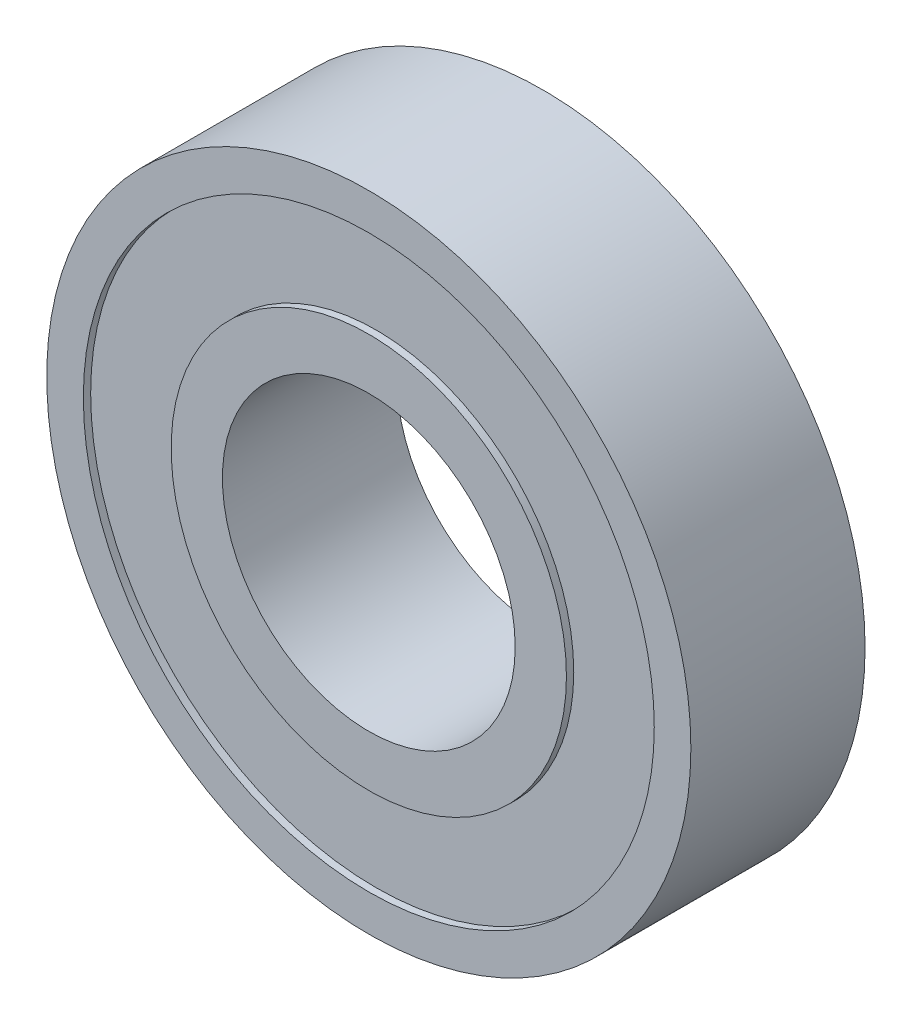
ISO-10303-21;
HEADER;
FILE_DESCRIPTION(('STEP AP214'),'2;1');
FILE_NAME('part.step','',(''),(''),'','','');
FILE_SCHEMA(('AUTOMOTIVE_DESIGN { 1 0 10303 214 1 1 1 1 }'));
ENDSEC;
DATA;
#1=APPLICATION_CONTEXT('core data for automotive mechanical design processes');
#2=APPLICATION_PROTOCOL_DEFINITION('international standard','automotive_design',2000,#1);
#3=PRODUCT_CONTEXT('',#1,'mechanical');
#4=PRODUCT('Part','Part','',(#3));
#5=PRODUCT_RELATED_PRODUCT_CATEGORY('part','',(#4));
#6=PRODUCT_DEFINITION_FORMATION('','',#4);
#7=PRODUCT_DEFINITION_CONTEXT('part definition',#1,'design');
#8=PRODUCT_DEFINITION('design','',#6,#7);
#9=PRODUCT_DEFINITION_SHAPE('','',#8);
#10=(LENGTH_UNIT() NAMED_UNIT(*) SI_UNIT(.MILLI.,.METRE.));
#11=(NAMED_UNIT(*) PLANE_ANGLE_UNIT() SI_UNIT($,.RADIAN.));
#12=(NAMED_UNIT(*) SI_UNIT($,.STERADIAN.) SOLID_ANGLE_UNIT());
#13=UNCERTAINTY_MEASURE_WITH_UNIT(LENGTH_MEASURE(1.E-05),#10,'distance_accuracy_value','');
#14=(GEOMETRIC_REPRESENTATION_CONTEXT(3) GLOBAL_UNCERTAINTY_ASSIGNED_CONTEXT((#13)) GLOBAL_UNIT_ASSIGNED_CONTEXT((#10,
#11,#12)) REPRESENTATION_CONTEXT('',''));
#15=CARTESIAN_POINT('',(0.,0.,0.));
#16=DIRECTION('',(0.,0.,1.));
#17=DIRECTION('',(1.,0.,0.));
#18=AXIS2_PLACEMENT_3D('',#15,#16,#17);
#19=CARTESIAN_POINT('',(0.,0.,0.));
#20=DIRECTION('',(0.,0.,1.));
#21=DIRECTION('',(1.,0.,0.));
#22=AXIS2_PLACEMENT_3D('',#19,#20,#21);
#23=PLANE('',#22);
#24=CARTESIAN_POINT('',(0.,0.,0.));
#25=DIRECTION('',(0.,0.,1.));
#26=DIRECTION('',(1.,0.,0.));
#27=AXIS2_PLACEMENT_3D('',#24,#25,#26);
#28=CIRCLE('',#27,5.);
#29=CARTESIAN_POINT('',(5.,0.,0.));
#30=VERTEX_POINT('',#29);
#31=EDGE_CURVE('E43',#30,#30,#28,.T.);
#32=ORIENTED_EDGE('',*,*,#31,.T.);
#33=EDGE_LOOP('',(#32));
#34=FACE_BOUND('',#33,.T.);
#35=CARTESIAN_POINT('',(0.,0.,0.));
#36=DIRECTION('',(0.,0.,1.));
#37=DIRECTION('',(1.,0.,0.));
#38=AXIS2_PLACEMENT_3D('',#35,#36,#37);
#39=CIRCLE('',#38,6.75);
#40=CARTESIAN_POINT('',(6.75,0.,0.));
#41=VERTEX_POINT('',#40);
#42=EDGE_CURVE('E67',#41,#41,#39,.T.);
#43=ORIENTED_EDGE('',*,*,#42,.F.);
#44=EDGE_LOOP('',(#43));
#45=FACE_BOUND('',#44,.T.);
#46=ADVANCED_FACE('F30',(#34,#45),#23,.F.);
#47=CARTESIAN_POINT('',(0.,0.,5.95));
#48=DIRECTION('',(0.,0.,1.));
#49=DIRECTION('',(1.,0.,0.));
#50=AXIS2_PLACEMENT_3D('',#47,#48,#49);
#51=PLANE('',#50);
#52=CARTESIAN_POINT('',(0.,0.,5.95));
#53=DIRECTION('',(0.,0.,1.));
#54=DIRECTION('',(1.,0.,0.));
#55=AXIS2_PLACEMENT_3D('',#52,#53,#54);
#56=CIRCLE('',#55,5.);
#57=CARTESIAN_POINT('',(5.,0.,5.95));
#58=VERTEX_POINT('',#57);
#59=EDGE_CURVE('E41',#58,#58,#56,.T.);
#60=ORIENTED_EDGE('',*,*,#59,.F.);
#61=EDGE_LOOP('',(#60));
#62=FACE_BOUND('',#61,.T.);
#63=CARTESIAN_POINT('',(0.,0.,5.95));
#64=DIRECTION('',(0.,0.,1.));
#65=DIRECTION('',(1.,0.,0.));
#66=AXIS2_PLACEMENT_3D('',#63,#64,#65);
#67=CIRCLE('',#66,6.75);
#68=CARTESIAN_POINT('',(6.75,0.,5.95));
#69=VERTEX_POINT('',#68);
#70=EDGE_CURVE('E55',#69,#69,#67,.T.);
#71=ORIENTED_EDGE('',*,*,#70,.T.);
#72=EDGE_LOOP('',(#71));
#73=FACE_BOUND('',#72,.T.);
#74=ADVANCED_FACE('F83',(#62,#73),#51,.T.);
#75=CARTESIAN_POINT('',(0.,0.,5.95));
#76=DIRECTION('',(0.,0.,1.));
#77=DIRECTION('',(1.,0.,0.));
#78=AXIS2_PLACEMENT_3D('',#75,#76,#77);
#79=CIRCLE('',#78,9.75);
#80=CARTESIAN_POINT('',(9.75,0.,5.95));
#81=VERTEX_POINT('',#80);
#82=EDGE_CURVE('E49',#81,#81,#79,.T.);
#83=ORIENTED_EDGE('',*,*,#82,.F.);
#84=EDGE_LOOP('',(#83));
#85=FACE_BOUND('',#84,.T.);
#86=CARTESIAN_POINT('',(0.,0.,5.95));
#87=DIRECTION('',(0.,0.,1.));
#88=DIRECTION('',(1.,0.,0.));
#89=AXIS2_PLACEMENT_3D('',#86,#87,#88);
#90=CIRCLE('',#89,11.);
#91=CARTESIAN_POINT('',(11.,0.,5.95));
#92=VERTEX_POINT('',#91);
#93=EDGE_CURVE('E10',#92,#92,#90,.T.);
#94=ORIENTED_EDGE('',*,*,#93,.T.);
#95=EDGE_LOOP('',(#94));
#96=FACE_BOUND('',#95,.T.);
#97=ADVANCED_FACE('F89',(#85,#96),#51,.T.);
#98=CARTESIAN_POINT('',(0.,0.,0.));
#99=DIRECTION('',(0.,0.,1.));
#100=DIRECTION('',(1.,0.,0.));
#101=AXIS2_PLACEMENT_3D('',#98,#99,#100);
#102=CIRCLE('',#101,9.75);
#103=CARTESIAN_POINT('',(9.75,0.,0.));
#104=VERTEX_POINT('',#103);
#105=EDGE_CURVE('E61',#104,#104,#102,.T.);
#106=ORIENTED_EDGE('',*,*,#105,.T.);
#107=EDGE_LOOP('',(#106));
#108=FACE_BOUND('',#107,.T.);
#109=CARTESIAN_POINT('',(0.,0.,0.));
#110=DIRECTION('',(0.,0.,1.));
#111=DIRECTION('',(1.,0.,0.));
#112=AXIS2_PLACEMENT_3D('',#109,#110,#111);
#113=CIRCLE('',#112,11.);
#114=CARTESIAN_POINT('',(11.,0.,0.));
#115=VERTEX_POINT('',#114);
#116=EDGE_CURVE('E34',#115,#115,#113,.T.);
#117=ORIENTED_EDGE('',*,*,#116,.F.);
#118=EDGE_LOOP('',(#117));
#119=FACE_BOUND('',#118,.T.);
#120=ADVANCED_FACE('F85',(#108,#119),#23,.F.);
#121=CARTESIAN_POINT('',(0.,0.,5.95));
#122=DIRECTION('',(0.,0.,-1.));
#123=DIRECTION('',(-1.,0.,0.));
#124=AXIS2_PLACEMENT_3D('',#121,#122,#123);
#125=CYLINDRICAL_SURFACE('',#124,11.);
#126=ORIENTED_EDGE('',*,*,#93,.F.);
#127=EDGE_LOOP('',(#126));
#128=FACE_BOUND('',#127,.T.);
#129=ORIENTED_EDGE('',*,*,#116,.T.);
#130=EDGE_LOOP('',(#129));
#131=FACE_BOUND('',#130,.T.);
#132=ADVANCED_FACE('F32',(#128,#131),#125,.T.);
#133=CARTESIAN_POINT('',(0.,0.,5.95));
#134=DIRECTION('',(0.,0.,-1.));
#135=DIRECTION('',(-1.,0.,0.));
#136=AXIS2_PLACEMENT_3D('',#133,#134,#135);
#137=CYLINDRICAL_SURFACE('',#136,5.);
#138=ORIENTED_EDGE('',*,*,#59,.T.);
#139=EDGE_LOOP('',(#138));
#140=FACE_BOUND('',#139,.T.);
#141=ORIENTED_EDGE('',*,*,#31,.F.);
#142=EDGE_LOOP('',(#141));
#143=FACE_BOUND('',#142,.T.);
#144=ADVANCED_FACE('F98',(#140,#143),#137,.F.);
#145=CARTESIAN_POINT('',(0.,0.,5.7));
#146=DIRECTION('',(0.,0.,1.));
#147=DIRECTION('',(1.,0.,0.));
#148=AXIS2_PLACEMENT_3D('',#145,#146,#147);
#149=CYLINDRICAL_SURFACE('',#148,9.75);
#150=CARTESIAN_POINT('',(0.,0.,5.7));
#151=DIRECTION('',(0.,0.,1.));
#152=DIRECTION('',(1.,0.,0.));
#153=AXIS2_PLACEMENT_3D('',#150,#151,#152);
#154=CIRCLE('',#153,9.75);
#155=CARTESIAN_POINT('',(9.75,0.,5.7));
#156=VERTEX_POINT('',#155);
#157=EDGE_CURVE('E46',#156,#156,#154,.T.);
#158=ORIENTED_EDGE('',*,*,#157,.F.);
#159=EDGE_LOOP('',(#158));
#160=FACE_BOUND('',#159,.T.);
#161=ORIENTED_EDGE('',*,*,#82,.T.);
#162=EDGE_LOOP('',(#161));
#163=FACE_BOUND('',#162,.T.);
#164=ADVANCED_FACE('F122',(#160,#163),#149,.F.);
#165=CARTESIAN_POINT('',(0.,0.,5.7));
#166=DIRECTION('',(0.,0.,1.));
#167=DIRECTION('',(1.,0.,0.));
#168=AXIS2_PLACEMENT_3D('',#165,#166,#167);
#169=PLANE('',#168);
#170=CARTESIAN_POINT('',(0.,0.,5.7));
#171=DIRECTION('',(0.,0.,1.));
#172=DIRECTION('',(1.,0.,0.));
#173=AXIS2_PLACEMENT_3D('',#170,#171,#172);
#174=CIRCLE('',#173,6.75);
#175=CARTESIAN_POINT('',(6.75,0.,5.7));
#176=VERTEX_POINT('',#175);
#177=EDGE_CURVE('E52',#176,#176,#174,.T.);
#178=ORIENTED_EDGE('',*,*,#177,.F.);
#179=EDGE_LOOP('',(#178));
#180=FACE_BOUND('',#179,.T.);
#181=ORIENTED_EDGE('',*,*,#157,.T.);
#182=EDGE_LOOP('',(#181));
#183=FACE_BOUND('',#182,.T.);
#184=ADVANCED_FACE('F118',(#180,#183),#169,.T.);
#185=CARTESIAN_POINT('',(0.,0.,5.7));
#186=DIRECTION('',(0.,0.,1.));
#187=DIRECTION('',(1.,0.,0.));
#188=AXIS2_PLACEMENT_3D('',#185,#186,#187);
#189=CYLINDRICAL_SURFACE('',#188,6.75);
#190=ORIENTED_EDGE('',*,*,#177,.T.);
#191=EDGE_LOOP('',(#190));
#192=FACE_BOUND('',#191,.T.);
#193=ORIENTED_EDGE('',*,*,#70,.F.);
#194=EDGE_LOOP('',(#193));
#195=FACE_BOUND('',#194,.T.);
#196=ADVANCED_FACE('F112',(#192,#195),#189,.T.);
#197=CARTESIAN_POINT('',(0.,0.,0.25));
#198=DIRECTION('',(0.,0.,-1.));
#199=DIRECTION('',(1.,0.,0.));
#200=AXIS2_PLACEMENT_3D('',#197,#198,#199);
#201=PLANE('',#200);
#202=CARTESIAN_POINT('',(0.,0.,0.25));
#203=DIRECTION('',(0.,0.,1.));
#204=DIRECTION('',(1.,0.,0.));
#205=AXIS2_PLACEMENT_3D('',#202,#203,#204);
#206=CIRCLE('',#205,9.75);
#207=CARTESIAN_POINT('',(9.75,0.,0.25));
#208=VERTEX_POINT('',#207);
#209=EDGE_CURVE('E58',#208,#208,#206,.T.);
#210=ORIENTED_EDGE('',*,*,#209,.F.);
#211=EDGE_LOOP('',(#210));
#212=FACE_BOUND('',#211,.T.);
#213=CARTESIAN_POINT('',(0.,0.,0.25));
#214=DIRECTION('',(0.,0.,1.));
#215=DIRECTION('',(1.,0.,0.));
#216=AXIS2_PLACEMENT_3D('',#213,#214,#215);
#217=CIRCLE('',#216,6.75);
#218=CARTESIAN_POINT('',(6.75,0.,0.25));
#219=VERTEX_POINT('',#218);
#220=EDGE_CURVE('E64',#219,#219,#217,.T.);
#221=ORIENTED_EDGE('',*,*,#220,.T.);
#222=EDGE_LOOP('',(#221));
#223=FACE_BOUND('',#222,.T.);
#224=ADVANCED_FACE('F73',(#212,#223),#201,.T.);
#225=CARTESIAN_POINT('',(0.,0.,0.25));
#226=DIRECTION('',(0.,0.,-1.));
#227=DIRECTION('',(-1.,0.,0.));
#228=AXIS2_PLACEMENT_3D('',#225,#226,#227);
#229=CYLINDRICAL_SURFACE('',#228,9.75);
#230=ORIENTED_EDGE('',*,*,#209,.T.);
#231=EDGE_LOOP('',(#230));
#232=FACE_BOUND('',#231,.T.);
#233=ORIENTED_EDGE('',*,*,#105,.F.);
#234=EDGE_LOOP('',(#233));
#235=FACE_BOUND('',#234,.T.);
#236=ADVANCED_FACE('F78',(#232,#235),#229,.F.);
#237=CARTESIAN_POINT('',(0.,0.,0.25));
#238=DIRECTION('',(0.,0.,-1.));
#239=DIRECTION('',(-1.,0.,0.));
#240=AXIS2_PLACEMENT_3D('',#237,#238,#239);
#241=CYLINDRICAL_SURFACE('',#240,6.75);
#242=ORIENTED_EDGE('',*,*,#220,.F.);
#243=EDGE_LOOP('',(#242));
#244=FACE_BOUND('',#243,.T.);
#245=ORIENTED_EDGE('',*,*,#42,.T.);
#246=EDGE_LOOP('',(#245));
#247=FACE_BOUND('',#246,.T.);
#248=ADVANCED_FACE('F75',(#244,#247),#241,.T.);
#249=CLOSED_SHELL('',(#46,#74,#97,#120,#132,#144,#164,#184,#196,#224,#236,#248));
#250=MANIFOLD_SOLID_BREP('B2',#249);
#251=ADVANCED_BREP_SHAPE_REPRESENTATION('',(#18,#250),#14);
#252=SHAPE_DEFINITION_REPRESENTATION(#9,#251);
ENDSEC;
END-ISO-10303-21;
